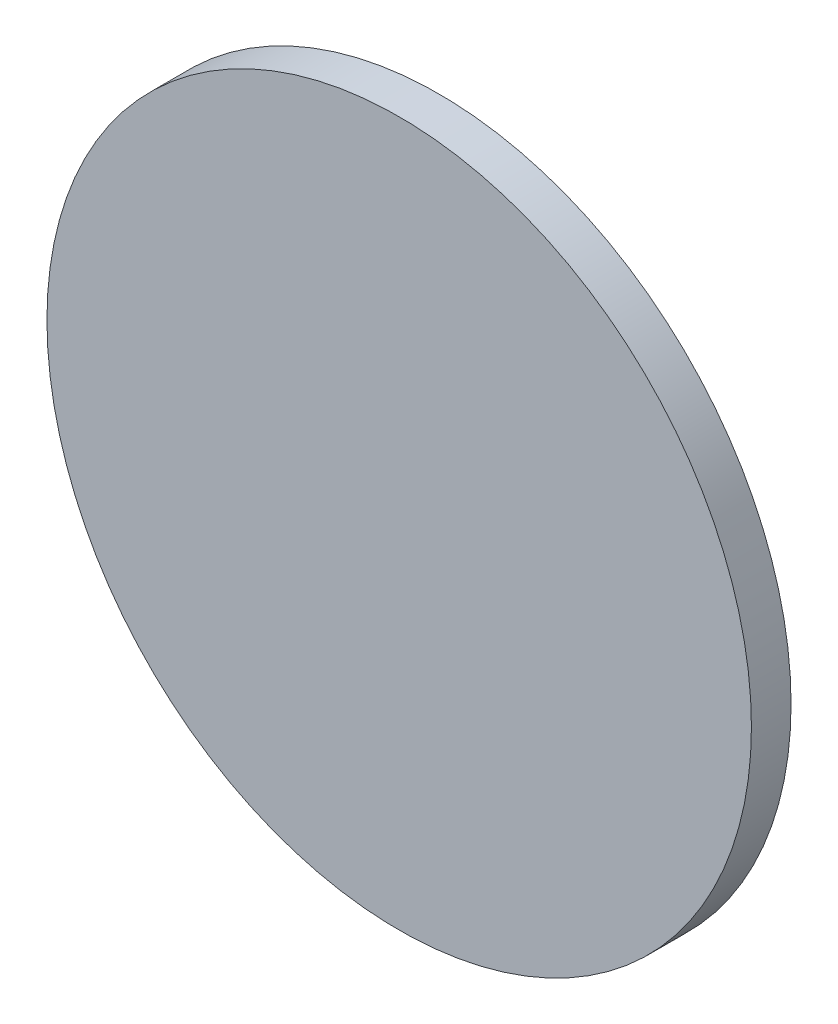
ISO-10303-21;
HEADER;
FILE_DESCRIPTION(('STEP AP214'),'2;1');
FILE_NAME('part.step','',(''),(''),'','','');
FILE_SCHEMA(('AUTOMOTIVE_DESIGN { 1 0 10303 214 1 1 1 1 }'));
ENDSEC;
DATA;
#1=APPLICATION_CONTEXT('core data for automotive mechanical design processes');
#2=APPLICATION_PROTOCOL_DEFINITION('international standard','automotive_design',2000,#1);
#3=PRODUCT_CONTEXT('',#1,'mechanical');
#4=PRODUCT('Part','Part','',(#3));
#5=PRODUCT_RELATED_PRODUCT_CATEGORY('part','',(#4));
#6=PRODUCT_DEFINITION_FORMATION('','',#4);
#7=PRODUCT_DEFINITION_CONTEXT('part definition',#1,'design');
#8=PRODUCT_DEFINITION('design','',#6,#7);
#9=PRODUCT_DEFINITION_SHAPE('','',#8);
#10=(LENGTH_UNIT() NAMED_UNIT(*) SI_UNIT(.MILLI.,.METRE.));
#11=(NAMED_UNIT(*) PLANE_ANGLE_UNIT() SI_UNIT($,.RADIAN.));
#12=(NAMED_UNIT(*) SI_UNIT($,.STERADIAN.) SOLID_ANGLE_UNIT());
#13=UNCERTAINTY_MEASURE_WITH_UNIT(LENGTH_MEASURE(1.E-05),#10,'distance_accuracy_value','');
#14=(GEOMETRIC_REPRESENTATION_CONTEXT(3) GLOBAL_UNCERTAINTY_ASSIGNED_CONTEXT((#13)) GLOBAL_UNIT_ASSIGNED_CONTEXT((#10,
#11,#12)) REPRESENTATION_CONTEXT('',''));
#15=CARTESIAN_POINT('',(0.,0.,0.));
#16=DIRECTION('',(0.,0.,1.));
#17=DIRECTION('',(1.,0.,0.));
#18=AXIS2_PLACEMENT_3D('',#15,#16,#17);
#19=CARTESIAN_POINT('',(2.14916,16.034908666667,0.76487));
#20=DIRECTION('',(0.,0.,-1.));
#21=DIRECTION('',(-1.,0.,0.));
#22=AXIS2_PLACEMENT_3D('',#19,#20,#21);
#23=PLANE('',#22);
#24=CARTESIAN_POINT('',(2.14916,16.034908666667,0.76487));
#25=DIRECTION('',(0.,0.,1.));
#26=DIRECTION('',(1.,0.,0.));
#27=AXIS2_PLACEMENT_3D('',#24,#25,#26);
#28=CIRCLE('',#27,0.1524);
#29=CARTESIAN_POINT('',(2.30156,16.034908666667,0.76487));
#30=VERTEX_POINT('',#29);
#31=EDGE_CURVE('E18',#30,#30,#28,.T.);
#32=ORIENTED_EDGE('',*,*,#31,.F.);
#33=EDGE_LOOP('',(#32));
#34=FACE_BOUND('',#33,.T.);
#35=ADVANCED_FACE('F15',(#34),#23,.T.);
#36=CARTESIAN_POINT('',(2.14916,16.034908666667,0.76487));
#37=DIRECTION('',(0.,0.,1.));
#38=DIRECTION('',(1.,0.,0.));
#39=AXIS2_PLACEMENT_3D('',#36,#37,#38);
#40=CYLINDRICAL_SURFACE('',#39,0.1524);
#41=CARTESIAN_POINT('',(2.14916,16.034908666667,0.782015));
#42=DIRECTION('',(0.,0.,1.));
#43=DIRECTION('',(1.,0.,0.));
#44=AXIS2_PLACEMENT_3D('',#41,#42,#43);
#45=CIRCLE('',#44,0.1524);
#46=CARTESIAN_POINT('',(2.30156,16.034908666667,0.782015));
#47=VERTEX_POINT('',#46);
#48=EDGE_CURVE('E10',#47,#47,#45,.T.);
#49=ORIENTED_EDGE('',*,*,#48,.F.);
#50=EDGE_LOOP('',(#49));
#51=FACE_BOUND('',#50,.T.);
#52=ORIENTED_EDGE('',*,*,#31,.T.);
#53=EDGE_LOOP('',(#52));
#54=FACE_BOUND('',#53,.T.);
#55=ADVANCED_FACE('F27',(#51,#54),#40,.T.);
#56=CARTESIAN_POINT('',(2.14916,16.034908666667,0.782015));
#57=DIRECTION('',(0.,0.,1.));
#58=DIRECTION('',(1.,0.,0.));
#59=AXIS2_PLACEMENT_3D('',#56,#57,#58);
#60=PLANE('',#59);
#61=ORIENTED_EDGE('',*,*,#48,.T.);
#62=EDGE_LOOP('',(#61));
#63=FACE_BOUND('',#62,.T.);
#64=ADVANCED_FACE('F34',(#63),#60,.T.);
#65=CLOSED_SHELL('',(#35,#55,#64));
#66=MANIFOLD_SOLID_BREP('B1',#65);
#67=ADVANCED_BREP_SHAPE_REPRESENTATION('',(#18,#66),#14);
#68=SHAPE_DEFINITION_REPRESENTATION(#9,#67);
ENDSEC;
END-ISO-10303-21;
